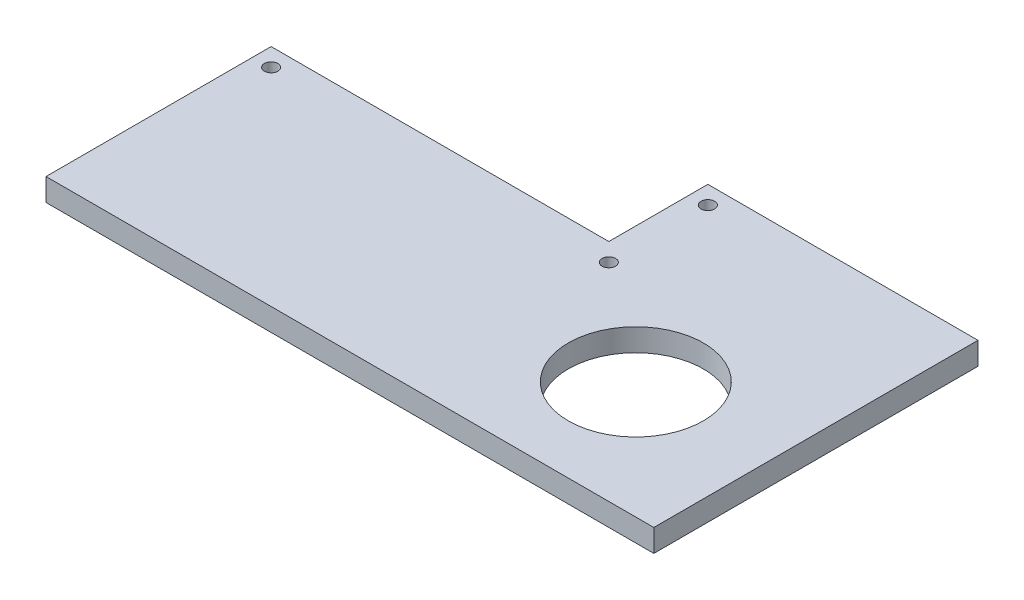
ISO-10303-21;
HEADER;
FILE_DESCRIPTION(('STEP AP214'),'2;1');
FILE_NAME('part.step','',(''),(''),'','','');
FILE_SCHEMA(('AUTOMOTIVE_DESIGN { 1 0 10303 214 1 1 1 1 }'));
ENDSEC;
DATA;
#1=APPLICATION_CONTEXT('core data for automotive mechanical design processes');
#2=APPLICATION_PROTOCOL_DEFINITION('international standard','automotive_design',2000,#1);
#3=PRODUCT_CONTEXT('',#1,'mechanical');
#4=PRODUCT('Part','Part','',(#3));
#5=PRODUCT_RELATED_PRODUCT_CATEGORY('part','',(#4));
#6=PRODUCT_DEFINITION_FORMATION('','',#4);
#7=PRODUCT_DEFINITION_CONTEXT('part definition',#1,'design');
#8=PRODUCT_DEFINITION('design','',#6,#7);
#9=PRODUCT_DEFINITION_SHAPE('','',#8);
#10=(LENGTH_UNIT() NAMED_UNIT(*) SI_UNIT(.MILLI.,.METRE.));
#11=(NAMED_UNIT(*) PLANE_ANGLE_UNIT() SI_UNIT($,.RADIAN.));
#12=(NAMED_UNIT(*) SI_UNIT($,.STERADIAN.) SOLID_ANGLE_UNIT());
#13=UNCERTAINTY_MEASURE_WITH_UNIT(LENGTH_MEASURE(1.E-05),#10,'distance_accuracy_value','');
#14=(GEOMETRIC_REPRESENTATION_CONTEXT(3) GLOBAL_UNCERTAINTY_ASSIGNED_CONTEXT((#13)) GLOBAL_UNIT_ASSIGNED_CONTEXT((#10,
#11,#12)) REPRESENTATION_CONTEXT('',''));
#15=CARTESIAN_POINT('',(0.,0.,0.));
#16=DIRECTION('',(0.,0.,1.));
#17=DIRECTION('',(1.,0.,0.));
#18=AXIS2_PLACEMENT_3D('',#15,#16,#17);
#19=CARTESIAN_POINT('',(0.,5.,0.));
#20=DIRECTION('',(0.,-1.,0.));
#21=DIRECTION('',(0.,0.,-1.));
#22=AXIS2_PLACEMENT_3D('',#19,#20,#21);
#23=PLANE('',#22);
#24=DIRECTION('',(0.,0.,1.));
#25=VECTOR('',#24,1.);
#26=CARTESIAN_POINT('',(-41.5,5.,57.));
#27=LINE('',#26,#25);
#28=CARTESIAN_POINT('',(-41.5,5.,7.));
#29=VERTEX_POINT('',#28);
#30=CARTESIAN_POINT('',(-41.5,5.,57.));
#31=VERTEX_POINT('',#30);
#32=EDGE_CURVE('E130',#29,#31,#27,.T.);
#33=ORIENTED_EDGE('',*,*,#32,.T.);
#34=DIRECTION('',(1.,0.,0.));
#35=VECTOR('',#34,1.);
#36=CARTESIAN_POINT('',(93.5,5.,57.));
#37=LINE('',#36,#35);
#38=CARTESIAN_POINT('',(93.5,5.,57.));
#39=VERTEX_POINT('',#38);
#40=EDGE_CURVE('E88',#31,#39,#37,.T.);
#41=ORIENTED_EDGE('',*,*,#40,.T.);
#42=DIRECTION('',(0.,0.,-1.));
#43=VECTOR('',#42,1.);
#44=CARTESIAN_POINT('',(93.5,5.,-15.));
#45=LINE('',#44,#43);
#46=CARTESIAN_POINT('',(93.5,5.,-15.));
#47=VERTEX_POINT('',#46);
#48=EDGE_CURVE('E101',#39,#47,#45,.T.);
#49=ORIENTED_EDGE('',*,*,#48,.T.);
#50=DIRECTION('',(-1.,0.,0.));
#51=VECTOR('',#50,1.);
#52=CARTESIAN_POINT('',(33.5,5.,-15.));
#53=LINE('',#52,#51);
#54=CARTESIAN_POINT('',(33.5,5.,-15.));
#55=VERTEX_POINT('',#54);
#56=EDGE_CURVE('E95',#47,#55,#53,.T.);
#57=ORIENTED_EDGE('',*,*,#56,.T.);
#58=DIRECTION('',(0.,0.,1.));
#59=VECTOR('',#58,1.);
#60=CARTESIAN_POINT('',(33.5,5.,7.));
#61=LINE('',#60,#59);
#62=CARTESIAN_POINT('',(33.5,5.,7.));
#63=VERTEX_POINT('',#62);
#64=EDGE_CURVE('E99',#55,#63,#61,.T.);
#65=ORIENTED_EDGE('',*,*,#64,.T.);
#66=DIRECTION('',(-1.,0.,0.));
#67=VECTOR('',#66,1.);
#68=CARTESIAN_POINT('',(-41.5,5.,7.));
#69=LINE('',#68,#67);
#70=EDGE_CURVE('E51',#63,#29,#69,.T.);
#71=ORIENTED_EDGE('',*,*,#70,.T.);
#72=EDGE_LOOP('',(#33,#41,#49,#57,#65,#71));
#73=FACE_BOUND('',#72,.T.);
#74=CARTESIAN_POINT('',(-37.5,5.,11.));
#75=DIRECTION('',(0.,1.,0.));
#76=DIRECTION('',(0.,0.,1.));
#77=AXIS2_PLACEMENT_3D('',#74,#75,#76);
#78=CIRCLE('',#77,1.5);
#79=CARTESIAN_POINT('',(-37.5,5.,12.5));
#80=VERTEX_POINT('',#79);
#81=EDGE_CURVE('E123',#80,#80,#78,.T.);
#82=ORIENTED_EDGE('',*,*,#81,.F.);
#83=EDGE_LOOP('',(#82));
#84=FACE_BOUND('',#83,.T.);
#85=CARTESIAN_POINT('',(37.5,5.,11.));
#86=DIRECTION('',(0.,1.,0.));
#87=DIRECTION('',(0.,0.,1.));
#88=AXIS2_PLACEMENT_3D('',#85,#86,#87);
#89=CIRCLE('',#88,1.5);
#90=CARTESIAN_POINT('',(37.5,5.,12.5));
#91=VERTEX_POINT('',#90);
#92=EDGE_CURVE('E194',#91,#91,#89,.T.);
#93=ORIENTED_EDGE('',*,*,#92,.F.);
#94=EDGE_LOOP('',(#93));
#95=FACE_BOUND('',#94,.T.);
#96=CARTESIAN_POINT('',(37.5,5.,-11.));
#97=DIRECTION('',(0.,1.,0.));
#98=DIRECTION('',(0.,0.,1.));
#99=AXIS2_PLACEMENT_3D('',#96,#97,#98);
#100=CIRCLE('',#99,1.5);
#101=CARTESIAN_POINT('',(37.5,5.,-9.5));
#102=VERTEX_POINT('',#101);
#103=EDGE_CURVE('E188',#102,#102,#100,.T.);
#104=ORIENTED_EDGE('',*,*,#103,.F.);
#105=EDGE_LOOP('',(#104));
#106=FACE_BOUND('',#105,.T.);
#107=CARTESIAN_POINT('',(63.5,5.,31.));
#108=DIRECTION('',(0.,1.,0.));
#109=DIRECTION('',(0.,0.,1.));
#110=AXIS2_PLACEMENT_3D('',#107,#108,#109);
#111=CIRCLE('',#110,15.);
#112=CARTESIAN_POINT('',(63.5,5.,46.));
#113=VERTEX_POINT('',#112);
#114=EDGE_CURVE('E179',#113,#113,#111,.T.);
#115=ORIENTED_EDGE('',*,*,#114,.F.);
#116=EDGE_LOOP('',(#115));
#117=FACE_BOUND('',#116,.T.);
#118=ADVANCED_FACE('F34',(#73,#84,#95,#106,#117),#23,.F.);
#119=CARTESIAN_POINT('',(0.,0.,0.));
#120=DIRECTION('',(0.,-1.,0.));
#121=DIRECTION('',(0.,0.,-1.));
#122=AXIS2_PLACEMENT_3D('',#119,#120,#121);
#123=PLANE('',#122);
#124=CARTESIAN_POINT('',(37.5,0.,-11.));
#125=DIRECTION('',(0.,1.,0.));
#126=DIRECTION('',(0.,0.,1.));
#127=AXIS2_PLACEMENT_3D('',#124,#125,#126);
#128=CIRCLE('',#127,1.5);
#129=CARTESIAN_POINT('',(37.5,0.,-9.5));
#130=VERTEX_POINT('',#129);
#131=EDGE_CURVE('E185',#130,#130,#128,.T.);
#132=ORIENTED_EDGE('',*,*,#131,.T.);
#133=EDGE_LOOP('',(#132));
#134=FACE_BOUND('',#133,.T.);
#135=CARTESIAN_POINT('',(-37.5,0.,11.));
#136=DIRECTION('',(0.,1.,0.));
#137=DIRECTION('',(0.,0.,1.));
#138=AXIS2_PLACEMENT_3D('',#135,#136,#137);
#139=CIRCLE('',#138,1.5);
#140=CARTESIAN_POINT('',(-37.5,0.,12.5));
#141=VERTEX_POINT('',#140);
#142=EDGE_CURVE('E197',#141,#141,#139,.T.);
#143=ORIENTED_EDGE('',*,*,#142,.T.);
#144=EDGE_LOOP('',(#143));
#145=FACE_BOUND('',#144,.T.);
#146=DIRECTION('',(0.,0.,1.));
#147=VECTOR('',#146,1.);
#148=CARTESIAN_POINT('',(-41.5,0.,57.));
#149=LINE('',#148,#147);
#150=CARTESIAN_POINT('',(-41.5,0.,7.));
#151=VERTEX_POINT('',#150);
#152=CARTESIAN_POINT('',(-41.5,0.,57.));
#153=VERTEX_POINT('',#152);
#154=EDGE_CURVE('E119',#151,#153,#149,.T.);
#155=ORIENTED_EDGE('',*,*,#154,.F.);
#156=DIRECTION('',(-1.,0.,0.));
#157=VECTOR('',#156,1.);
#158=CARTESIAN_POINT('',(-41.5,0.,7.));
#159=LINE('',#158,#157);
#160=CARTESIAN_POINT('',(33.5,0.,7.));
#161=VERTEX_POINT('',#160);
#162=EDGE_CURVE('E80',#161,#151,#159,.T.);
#163=ORIENTED_EDGE('',*,*,#162,.F.);
#164=DIRECTION('',(0.,0.,1.));
#165=VECTOR('',#164,1.);
#166=CARTESIAN_POINT('',(33.5,0.,7.));
#167=LINE('',#166,#165);
#168=CARTESIAN_POINT('',(33.5,0.,-15.));
#169=VERTEX_POINT('',#168);
#170=EDGE_CURVE('E74',#169,#161,#167,.T.);
#171=ORIENTED_EDGE('',*,*,#170,.F.);
#172=DIRECTION('',(-1.,0.,0.));
#173=VECTOR('',#172,1.);
#174=CARTESIAN_POINT('',(33.5,0.,-15.));
#175=LINE('',#174,#173);
#176=CARTESIAN_POINT('',(93.5,0.,-15.));
#177=VERTEX_POINT('',#176);
#178=EDGE_CURVE('E109',#177,#169,#175,.T.);
#179=ORIENTED_EDGE('',*,*,#178,.F.);
#180=DIRECTION('',(0.,0.,-1.));
#181=VECTOR('',#180,1.);
#182=CARTESIAN_POINT('',(93.5,0.,-15.));
#183=LINE('',#182,#181);
#184=CARTESIAN_POINT('',(93.5,0.,57.));
#185=VERTEX_POINT('',#184);
#186=EDGE_CURVE('E125',#185,#177,#183,.T.);
#187=ORIENTED_EDGE('',*,*,#186,.F.);
#188=DIRECTION('',(1.,0.,0.));
#189=VECTOR('',#188,1.);
#190=CARTESIAN_POINT('',(93.5,0.,57.));
#191=LINE('',#190,#189);
#192=EDGE_CURVE('E122',#153,#185,#191,.T.);
#193=ORIENTED_EDGE('',*,*,#192,.F.);
#194=EDGE_LOOP('',(#155,#163,#171,#179,#187,#193));
#195=FACE_BOUND('',#194,.T.);
#196=CARTESIAN_POINT('',(37.5,0.,11.));
#197=DIRECTION('',(0.,1.,0.));
#198=DIRECTION('',(0.,0.,1.));
#199=AXIS2_PLACEMENT_3D('',#196,#197,#198);
#200=CIRCLE('',#199,1.5);
#201=CARTESIAN_POINT('',(37.5,0.,12.5));
#202=VERTEX_POINT('',#201);
#203=EDGE_CURVE('E191',#202,#202,#200,.T.);
#204=ORIENTED_EDGE('',*,*,#203,.T.);
#205=EDGE_LOOP('',(#204));
#206=FACE_BOUND('',#205,.T.);
#207=CARTESIAN_POINT('',(63.5,0.,31.));
#208=DIRECTION('',(0.,1.,0.));
#209=DIRECTION('',(0.,0.,1.));
#210=AXIS2_PLACEMENT_3D('',#207,#208,#209);
#211=CIRCLE('',#210,15.);
#212=CARTESIAN_POINT('',(63.5,0.,46.));
#213=VERTEX_POINT('',#212);
#214=EDGE_CURVE('E182',#213,#213,#211,.T.);
#215=ORIENTED_EDGE('',*,*,#214,.T.);
#216=EDGE_LOOP('',(#215));
#217=FACE_BOUND('',#216,.T.);
#218=ADVANCED_FACE('F139',(#134,#145,#195,#206,#217),#123,.T.);
#219=CARTESIAN_POINT('',(-41.5,5.,57.));
#220=DIRECTION('',(1.,0.,0.));
#221=DIRECTION('',(0.,0.,-1.));
#222=AXIS2_PLACEMENT_3D('',#219,#220,#221);
#223=PLANE('',#222);
#224=ORIENTED_EDGE('',*,*,#154,.T.);
#225=DIRECTION('',(0.,-1.,0.));
#226=VECTOR('',#225,1.);
#227=CARTESIAN_POINT('',(-41.5,5.,57.));
#228=LINE('',#227,#226);
#229=EDGE_CURVE('E11',#31,#153,#228,.T.);
#230=ORIENTED_EDGE('',*,*,#229,.F.);
#231=ORIENTED_EDGE('',*,*,#32,.F.);
#232=DIRECTION('',(0.,-1.,0.));
#233=VECTOR('',#232,1.);
#234=CARTESIAN_POINT('',(-41.5,5.,7.));
#235=LINE('',#234,#233);
#236=EDGE_CURVE('E115',#29,#151,#235,.T.);
#237=ORIENTED_EDGE('',*,*,#236,.T.);
#238=EDGE_LOOP('',(#224,#230,#231,#237));
#239=FACE_BOUND('',#238,.T.);
#240=ADVANCED_FACE('F36',(#239),#223,.F.);
#241=CARTESIAN_POINT('',(93.5,5.,57.));
#242=DIRECTION('',(0.,0.,-1.));
#243=DIRECTION('',(-1.,0.,0.));
#244=AXIS2_PLACEMENT_3D('',#241,#242,#243);
#245=PLANE('',#244);
#246=ORIENTED_EDGE('',*,*,#192,.T.);
#247=DIRECTION('',(0.,-1.,0.));
#248=VECTOR('',#247,1.);
#249=CARTESIAN_POINT('',(93.5,5.,57.));
#250=LINE('',#249,#248);
#251=EDGE_CURVE('E43',#39,#185,#250,.T.);
#252=ORIENTED_EDGE('',*,*,#251,.F.);
#253=ORIENTED_EDGE('',*,*,#40,.F.);
#254=ORIENTED_EDGE('',*,*,#229,.T.);
#255=EDGE_LOOP('',(#246,#252,#253,#254));
#256=FACE_BOUND('',#255,.T.);
#257=ADVANCED_FACE('F257',(#256),#245,.F.);
#258=CARTESIAN_POINT('',(93.5,5.,-15.));
#259=DIRECTION('',(-1.,0.,0.));
#260=DIRECTION('',(0.,0.,1.));
#261=AXIS2_PLACEMENT_3D('',#258,#259,#260);
#262=PLANE('',#261);
#263=ORIENTED_EDGE('',*,*,#186,.T.);
#264=DIRECTION('',(0.,-1.,0.));
#265=VECTOR('',#264,1.);
#266=CARTESIAN_POINT('',(93.5,5.,-15.));
#267=LINE('',#266,#265);
#268=EDGE_CURVE('E110',#47,#177,#267,.T.);
#269=ORIENTED_EDGE('',*,*,#268,.F.);
#270=ORIENTED_EDGE('',*,*,#48,.F.);
#271=ORIENTED_EDGE('',*,*,#251,.T.);
#272=EDGE_LOOP('',(#263,#269,#270,#271));
#273=FACE_BOUND('',#272,.T.);
#274=ADVANCED_FACE('F136',(#273),#262,.F.);
#275=CARTESIAN_POINT('',(33.5,5.,-15.));
#276=DIRECTION('',(0.,0.,1.));
#277=DIRECTION('',(1.,0.,0.));
#278=AXIS2_PLACEMENT_3D('',#275,#276,#277);
#279=PLANE('',#278);
#280=ORIENTED_EDGE('',*,*,#178,.T.);
#281=DIRECTION('',(0.,-1.,0.));
#282=VECTOR('',#281,1.);
#283=CARTESIAN_POINT('',(33.5,5.,-15.));
#284=LINE('',#283,#282);
#285=EDGE_CURVE('E106',#55,#169,#284,.T.);
#286=ORIENTED_EDGE('',*,*,#285,.F.);
#287=ORIENTED_EDGE('',*,*,#56,.F.);
#288=ORIENTED_EDGE('',*,*,#268,.T.);
#289=EDGE_LOOP('',(#280,#286,#287,#288));
#290=FACE_BOUND('',#289,.T.);
#291=ADVANCED_FACE('F107',(#290),#279,.F.);
#292=CARTESIAN_POINT('',(33.5,5.,7.));
#293=DIRECTION('',(1.,0.,0.));
#294=DIRECTION('',(0.,0.,-1.));
#295=AXIS2_PLACEMENT_3D('',#292,#293,#294);
#296=PLANE('',#295);
#297=ORIENTED_EDGE('',*,*,#170,.T.);
#298=DIRECTION('',(0.,-1.,0.));
#299=VECTOR('',#298,1.);
#300=CARTESIAN_POINT('',(33.5,5.,7.));
#301=LINE('',#300,#299);
#302=EDGE_CURVE('E111',#63,#161,#301,.T.);
#303=ORIENTED_EDGE('',*,*,#302,.F.);
#304=ORIENTED_EDGE('',*,*,#64,.F.);
#305=ORIENTED_EDGE('',*,*,#285,.T.);
#306=EDGE_LOOP('',(#297,#303,#304,#305));
#307=FACE_BOUND('',#306,.T.);
#308=ADVANCED_FACE('F113',(#307),#296,.F.);
#309=CARTESIAN_POINT('',(-41.5,5.,7.));
#310=DIRECTION('',(0.,0.,1.));
#311=DIRECTION('',(1.,0.,0.));
#312=AXIS2_PLACEMENT_3D('',#309,#310,#311);
#313=PLANE('',#312);
#314=ORIENTED_EDGE('',*,*,#162,.T.);
#315=ORIENTED_EDGE('',*,*,#236,.F.);
#316=ORIENTED_EDGE('',*,*,#70,.F.);
#317=ORIENTED_EDGE('',*,*,#302,.T.);
#318=EDGE_LOOP('',(#314,#315,#316,#317));
#319=FACE_BOUND('',#318,.T.);
#320=ADVANCED_FACE('F144',(#319),#313,.F.);
#321=CARTESIAN_POINT('',(-37.5,5.,11.));
#322=DIRECTION('',(0.,-1.,0.));
#323=DIRECTION('',(0.,0.,-1.));
#324=AXIS2_PLACEMENT_3D('',#321,#322,#323);
#325=CYLINDRICAL_SURFACE('',#324,1.5);
#326=ORIENTED_EDGE('',*,*,#81,.T.);
#327=EDGE_LOOP('',(#326));
#328=FACE_BOUND('',#327,.T.);
#329=ORIENTED_EDGE('',*,*,#142,.F.);
#330=EDGE_LOOP('',(#329));
#331=FACE_BOUND('',#330,.T.);
#332=ADVANCED_FACE('F146',(#328,#331),#325,.F.);
#333=CARTESIAN_POINT('',(37.5,5.,11.));
#334=DIRECTION('',(0.,-1.,0.));
#335=DIRECTION('',(0.,0.,-1.));
#336=AXIS2_PLACEMENT_3D('',#333,#334,#335);
#337=CYLINDRICAL_SURFACE('',#336,1.5);
#338=ORIENTED_EDGE('',*,*,#92,.T.);
#339=EDGE_LOOP('',(#338));
#340=FACE_BOUND('',#339,.T.);
#341=ORIENTED_EDGE('',*,*,#203,.F.);
#342=EDGE_LOOP('',(#341));
#343=FACE_BOUND('',#342,.T.);
#344=ADVANCED_FACE('F152',(#340,#343),#337,.F.);
#345=CARTESIAN_POINT('',(37.5,5.,-11.));
#346=DIRECTION('',(0.,-1.,0.));
#347=DIRECTION('',(0.,0.,-1.));
#348=AXIS2_PLACEMENT_3D('',#345,#346,#347);
#349=CYLINDRICAL_SURFACE('',#348,1.5);
#350=ORIENTED_EDGE('',*,*,#103,.T.);
#351=EDGE_LOOP('',(#350));
#352=FACE_BOUND('',#351,.T.);
#353=ORIENTED_EDGE('',*,*,#131,.F.);
#354=EDGE_LOOP('',(#353));
#355=FACE_BOUND('',#354,.T.);
#356=ADVANCED_FACE('F166',(#352,#355),#349,.F.);
#357=CARTESIAN_POINT('',(63.5,5.,31.));
#358=DIRECTION('',(0.,-1.,0.));
#359=DIRECTION('',(0.,0.,-1.));
#360=AXIS2_PLACEMENT_3D('',#357,#358,#359);
#361=CYLINDRICAL_SURFACE('',#360,15.);
#362=ORIENTED_EDGE('',*,*,#114,.T.);
#363=EDGE_LOOP('',(#362));
#364=FACE_BOUND('',#363,.T.);
#365=ORIENTED_EDGE('',*,*,#214,.F.);
#366=EDGE_LOOP('',(#365));
#367=FACE_BOUND('',#366,.T.);
#368=ADVANCED_FACE('F170',(#364,#367),#361,.F.);
#369=CLOSED_SHELL('',(#118,#218,#240,#257,#274,#291,#308,#320,#332,#344,#356,#368));
#370=MANIFOLD_SOLID_BREP('B2',#369);
#371=ADVANCED_BREP_SHAPE_REPRESENTATION('',(#18,#370),#14);
#372=SHAPE_DEFINITION_REPRESENTATION(#9,#371);
ENDSEC;
END-ISO-10303-21;
